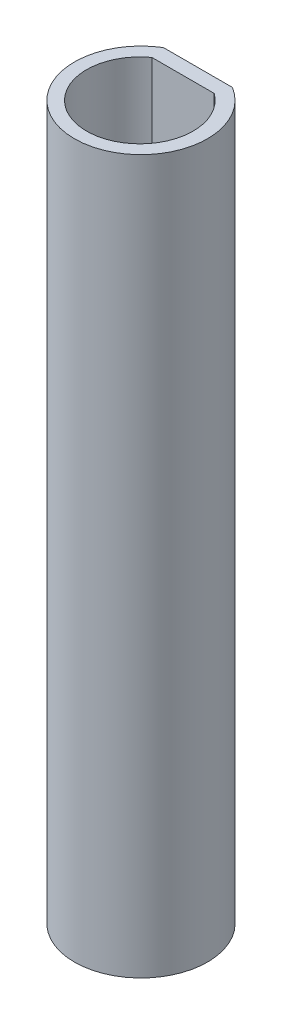
ISO-10303-21;
HEADER;
FILE_DESCRIPTION(('STEP AP214'),'2;1');
FILE_NAME('part.step','',(''),(''),'','','');
FILE_SCHEMA(('AUTOMOTIVE_DESIGN { 1 0 10303 214 1 1 1 1 }'));
ENDSEC;
DATA;
#1=APPLICATION_CONTEXT('core data for automotive mechanical design processes');
#2=APPLICATION_PROTOCOL_DEFINITION('international standard','automotive_design',2000,#1);
#3=PRODUCT_CONTEXT('',#1,'mechanical');
#4=PRODUCT('Part','Part','',(#3));
#5=PRODUCT_RELATED_PRODUCT_CATEGORY('part','',(#4));
#6=PRODUCT_DEFINITION_FORMATION('','',#4);
#7=PRODUCT_DEFINITION_CONTEXT('part definition',#1,'design');
#8=PRODUCT_DEFINITION('design','',#6,#7);
#9=PRODUCT_DEFINITION_SHAPE('','',#8);
#10=(LENGTH_UNIT() NAMED_UNIT(*) SI_UNIT(.MILLI.,.METRE.));
#11=(NAMED_UNIT(*) PLANE_ANGLE_UNIT() SI_UNIT($,.RADIAN.));
#12=(NAMED_UNIT(*) SI_UNIT($,.STERADIAN.) SOLID_ANGLE_UNIT());
#13=UNCERTAINTY_MEASURE_WITH_UNIT(LENGTH_MEASURE(1.E-05),#10,'distance_accuracy_value','');
#14=(GEOMETRIC_REPRESENTATION_CONTEXT(3) GLOBAL_UNCERTAINTY_ASSIGNED_CONTEXT((#13)) GLOBAL_UNIT_ASSIGNED_CONTEXT((#10,
#11,#12)) REPRESENTATION_CONTEXT('',''));
#15=CARTESIAN_POINT('',(0.,0.,0.));
#16=DIRECTION('',(0.,0.,1.));
#17=DIRECTION('',(1.,0.,0.));
#18=AXIS2_PLACEMENT_3D('',#15,#16,#17);
#19=CARTESIAN_POINT('',(0.,15.,0.));
#20=DIRECTION('',(0.,-1.,0.));
#21=DIRECTION('',(0.,0.,-1.));
#22=AXIS2_PLACEMENT_3D('',#19,#20,#21);
#23=CYLINDRICAL_SURFACE('',#22,1.4);
#24=CARTESIAN_POINT('',(0.,0.,0.));
#25=DIRECTION('',(0.,1.,0.));
#26=DIRECTION('',(0.,0.,1.));
#27=AXIS2_PLACEMENT_3D('',#24,#25,#26);
#28=CIRCLE('',#27,1.4);
#29=CARTESIAN_POINT('',(-0.725,0.,-1.19765395670035));
#30=VERTEX_POINT('',#29);
#31=CARTESIAN_POINT('',(0.725,0.,-1.19765395670035));
#32=VERTEX_POINT('',#31);
#33=EDGE_CURVE('E89',#30,#32,#28,.T.);
#34=ORIENTED_EDGE('',*,*,#33,.T.);
#35=DIRECTION('',(0.,-1.,0.));
#36=VECTOR('',#35,1.);
#37=CARTESIAN_POINT('',(0.725,15.,-1.19765395670035));
#38=LINE('',#37,#36);
#39=CARTESIAN_POINT('',(0.725,15.,-1.19765395670035));
#40=VERTEX_POINT('',#39);
#41=EDGE_CURVE('E11',#40,#32,#38,.T.);
#42=ORIENTED_EDGE('',*,*,#41,.F.);
#43=CARTESIAN_POINT('',(0.,15.,0.));
#44=DIRECTION('',(0.,1.,0.));
#45=DIRECTION('',(0.,0.,1.));
#46=AXIS2_PLACEMENT_3D('',#43,#44,#45);
#47=CIRCLE('',#46,1.4);
#48=CARTESIAN_POINT('',(-0.725,15.,-1.19765395670035));
#49=VERTEX_POINT('',#48);
#50=EDGE_CURVE('E91',#49,#40,#47,.T.);
#51=ORIENTED_EDGE('',*,*,#50,.F.);
#52=DIRECTION('',(0.,-1.,0.));
#53=VECTOR('',#52,1.);
#54=CARTESIAN_POINT('',(-0.725,15.,-1.19765395670035));
#55=LINE('',#54,#53);
#56=EDGE_CURVE('E40',#49,#30,#55,.T.);
#57=ORIENTED_EDGE('',*,*,#56,.T.);
#58=EDGE_LOOP('',(#34,#42,#51,#57));
#59=FACE_BOUND('',#58,.T.);
#60=ADVANCED_FACE('F33',(#59),#23,.T.);
#61=CARTESIAN_POINT('',(-0.725,15.,-1.19765395670035));
#62=DIRECTION('',(0.,0.,1.));
#63=DIRECTION('',(1.,0.,0.));
#64=AXIS2_PLACEMENT_3D('',#61,#62,#63);
#65=PLANE('',#64);
#66=DIRECTION('',(-1.,0.,0.));
#67=VECTOR('',#66,1.);
#68=CARTESIAN_POINT('',(-0.725,0.,-1.19765395670035));
#69=LINE('',#68,#67);
#70=EDGE_CURVE('E95',#32,#30,#69,.T.);
#71=ORIENTED_EDGE('',*,*,#70,.T.);
#72=ORIENTED_EDGE('',*,*,#56,.F.);
#73=DIRECTION('',(-1.,0.,0.));
#74=VECTOR('',#73,1.);
#75=CARTESIAN_POINT('',(-0.725,15.,-1.19765395670035));
#76=LINE('',#75,#74);
#77=EDGE_CURVE('E94',#40,#49,#76,.T.);
#78=ORIENTED_EDGE('',*,*,#77,.F.);
#79=ORIENTED_EDGE('',*,*,#41,.T.);
#80=EDGE_LOOP('',(#71,#72,#78,#79));
#81=FACE_BOUND('',#80,.T.);
#82=ADVANCED_FACE('F108',(#81),#65,.F.);
#83=CARTESIAN_POINT('',(0.,15.,0.));
#84=DIRECTION('',(0.,1.,0.));
#85=DIRECTION('',(0.,0.,1.));
#86=AXIS2_PLACEMENT_3D('',#83,#84,#85);
#87=PLANE('',#86);
#88=CARTESIAN_POINT('',(-0.0112324911745519,15.,0.0124776112829254));
#89=DIRECTION('',(0.,-1.,0.));
#90=DIRECTION('',(0.,0.,-1.));
#91=AXIS2_PLACEMENT_3D('',#88,#89,#90);
#92=CIRCLE('',#91,1.12085140663719);
#93=CARTESIAN_POINT('',(0.643996160673863,15.,-0.896908604555803));
#94=VERTEX_POINT('',#93);
#95=CARTESIAN_POINT('',(-0.666461143022967,15.,-0.896908604555803));
#96=VERTEX_POINT('',#95);
#97=EDGE_CURVE('E47',#94,#96,#92,.T.);
#98=ORIENTED_EDGE('',*,*,#97,.T.);
#99=DIRECTION('',(1.,0.,0.));
#100=VECTOR('',#99,1.);
#101=CARTESIAN_POINT('',(0.643996160673863,15.,-0.896908604555803));
#102=LINE('',#101,#100);
#103=EDGE_CURVE('E76',#96,#94,#102,.T.);
#104=ORIENTED_EDGE('',*,*,#103,.T.);
#105=EDGE_LOOP('',(#98,#104));
#106=FACE_BOUND('',#105,.T.);
#107=ORIENTED_EDGE('',*,*,#50,.T.);
#108=ORIENTED_EDGE('',*,*,#77,.T.);
#109=EDGE_LOOP('',(#107,#108));
#110=FACE_BOUND('',#109,.T.);
#111=ADVANCED_FACE('F82',(#106,#110),#87,.T.);
#112=CARTESIAN_POINT('',(0.,0.,0.));
#113=DIRECTION('',(0.,1.,0.));
#114=DIRECTION('',(0.,0.,1.));
#115=AXIS2_PLACEMENT_3D('',#112,#113,#114);
#116=PLANE('',#115);
#117=DIRECTION('',(1.,0.,0.));
#118=VECTOR('',#117,1.);
#119=CARTESIAN_POINT('',(0.643996160673863,0.,-0.896908604555803));
#120=LINE('',#119,#118);
#121=CARTESIAN_POINT('',(-0.666461143022967,0.,-0.896908604555803));
#122=VERTEX_POINT('',#121);
#123=CARTESIAN_POINT('',(0.643996160673863,0.,-0.896908604555803));
#124=VERTEX_POINT('',#123);
#125=EDGE_CURVE('E84',#122,#124,#120,.T.);
#126=ORIENTED_EDGE('',*,*,#125,.F.);
#127=CARTESIAN_POINT('',(-0.0112324911745519,0.,0.0124776112829254));
#128=DIRECTION('',(0.,-1.,0.));
#129=DIRECTION('',(0.,0.,-1.));
#130=AXIS2_PLACEMENT_3D('',#127,#128,#129);
#131=CIRCLE('',#130,1.12085140663719);
#132=EDGE_CURVE('E52',#124,#122,#131,.T.);
#133=ORIENTED_EDGE('',*,*,#132,.F.);
#134=EDGE_LOOP('',(#126,#133));
#135=FACE_BOUND('',#134,.T.);
#136=ORIENTED_EDGE('',*,*,#33,.F.);
#137=ORIENTED_EDGE('',*,*,#70,.F.);
#138=EDGE_LOOP('',(#136,#137));
#139=FACE_BOUND('',#138,.T.);
#140=ADVANCED_FACE('F107',(#135,#139),#116,.F.);
#141=CARTESIAN_POINT('',(-0.0112324911745519,15.,0.0124776112829254));
#142=DIRECTION('',(0.,-1.,0.));
#143=DIRECTION('',(0.,0.,-1.));
#144=AXIS2_PLACEMENT_3D('',#141,#142,#143);
#145=CYLINDRICAL_SURFACE('',#144,1.12085140663719);
#146=ORIENTED_EDGE('',*,*,#132,.T.);
#147=DIRECTION('',(0.,-1.,0.));
#148=VECTOR('',#147,1.);
#149=CARTESIAN_POINT('',(-0.666461143022967,15.,-0.896908604555803));
#150=LINE('',#149,#148);
#151=EDGE_CURVE('E69',#96,#122,#150,.T.);
#152=ORIENTED_EDGE('',*,*,#151,.F.);
#153=ORIENTED_EDGE('',*,*,#97,.F.);
#154=DIRECTION('',(0.,-1.,0.));
#155=VECTOR('',#154,1.);
#156=CARTESIAN_POINT('',(0.643996160673863,15.,-0.896908604555803));
#157=LINE('',#156,#155);
#158=EDGE_CURVE('E75',#94,#124,#157,.T.);
#159=ORIENTED_EDGE('',*,*,#158,.T.);
#160=EDGE_LOOP('',(#146,#152,#153,#159));
#161=FACE_BOUND('',#160,.T.);
#162=ADVANCED_FACE('F71',(#161),#145,.F.);
#163=CARTESIAN_POINT('',(0.643996160673863,15.,-0.896908604555803));
#164=DIRECTION('',(0.,0.,-1.));
#165=DIRECTION('',(-1.,0.,0.));
#166=AXIS2_PLACEMENT_3D('',#163,#164,#165);
#167=PLANE('',#166);
#168=ORIENTED_EDGE('',*,*,#125,.T.);
#169=ORIENTED_EDGE('',*,*,#158,.F.);
#170=ORIENTED_EDGE('',*,*,#103,.F.);
#171=ORIENTED_EDGE('',*,*,#151,.T.);
#172=EDGE_LOOP('',(#168,#169,#170,#171));
#173=FACE_BOUND('',#172,.T.);
#174=ADVANCED_FACE('F79',(#173),#167,.F.);
#175=CLOSED_SHELL('',(#60,#82,#111,#140,#162,#174));
#176=MANIFOLD_SOLID_BREP('B2',#175);
#177=ADVANCED_BREP_SHAPE_REPRESENTATION('',(#18,#176),#14);
#178=SHAPE_DEFINITION_REPRESENTATION(#9,#177);
ENDSEC;
END-ISO-10303-21;
